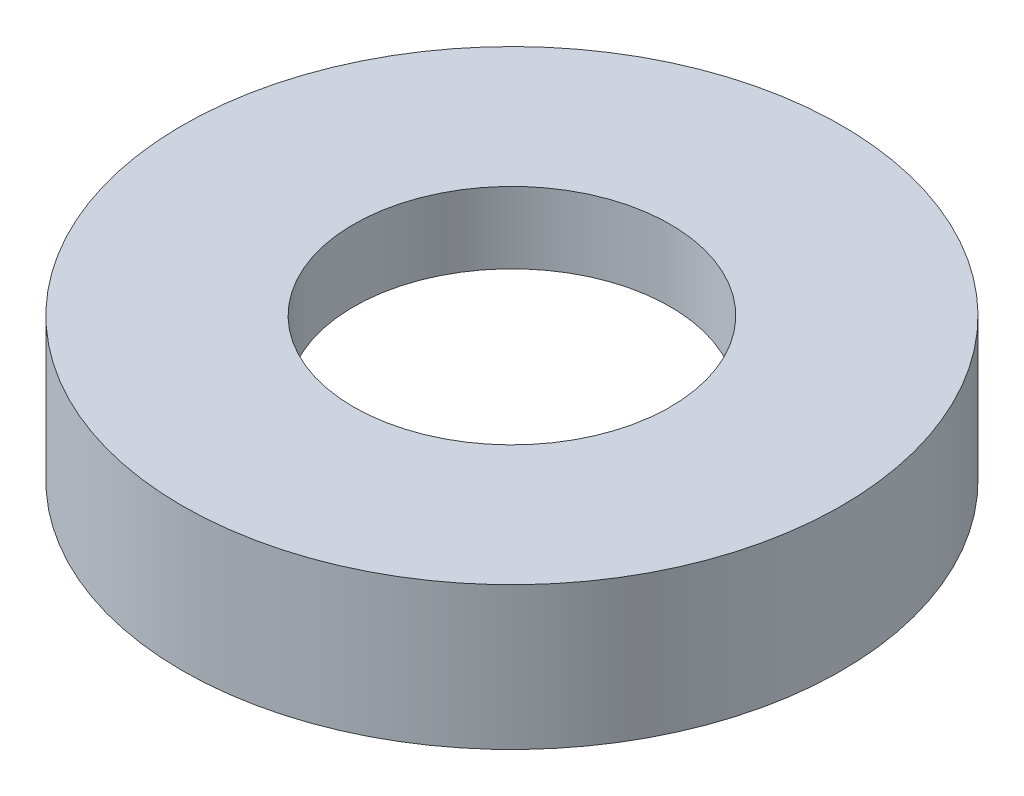
ISO-10303-21;
HEADER;
FILE_DESCRIPTION(('STEP AP214'),'2;1');
FILE_NAME('part.step','',(''),(''),'','','');
FILE_SCHEMA(('AUTOMOTIVE_DESIGN { 1 0 10303 214 1 1 1 1 }'));
ENDSEC;
DATA;
#1=APPLICATION_CONTEXT('core data for automotive mechanical design processes');
#2=APPLICATION_PROTOCOL_DEFINITION('international standard','automotive_design',2000,#1);
#3=PRODUCT_CONTEXT('',#1,'mechanical');
#4=PRODUCT('Part','Part','',(#3));
#5=PRODUCT_RELATED_PRODUCT_CATEGORY('part','',(#4));
#6=PRODUCT_DEFINITION_FORMATION('','',#4);
#7=PRODUCT_DEFINITION_CONTEXT('part definition',#1,'design');
#8=PRODUCT_DEFINITION('design','',#6,#7);
#9=PRODUCT_DEFINITION_SHAPE('','',#8);
#10=(LENGTH_UNIT() NAMED_UNIT(*) SI_UNIT(.MILLI.,.METRE.));
#11=(NAMED_UNIT(*) PLANE_ANGLE_UNIT() SI_UNIT($,.RADIAN.));
#12=(NAMED_UNIT(*) SI_UNIT($,.STERADIAN.) SOLID_ANGLE_UNIT());
#13=UNCERTAINTY_MEASURE_WITH_UNIT(LENGTH_MEASURE(1.E-05),#10,'distance_accuracy_value','');
#14=(GEOMETRIC_REPRESENTATION_CONTEXT(3) GLOBAL_UNCERTAINTY_ASSIGNED_CONTEXT((#13)) GLOBAL_UNIT_ASSIGNED_CONTEXT((#10,
#11,#12)) REPRESENTATION_CONTEXT('',''));
#15=CARTESIAN_POINT('',(0.,0.,0.));
#16=DIRECTION('',(0.,0.,1.));
#17=DIRECTION('',(1.,0.,0.));
#18=AXIS2_PLACEMENT_3D('',#15,#16,#17);
#19=CARTESIAN_POINT('',(25.4,0.,0.));
#20=DIRECTION('',(0.,1.,0.));
#21=DIRECTION('',(0.,0.,1.));
#22=AXIS2_PLACEMENT_3D('',#19,#20,#21);
#23=PLANE('',#22);
#24=CARTESIAN_POINT('',(0.,0.,0.));
#25=DIRECTION('',(0.,1.,0.));
#26=DIRECTION('',(0.,0.,1.));
#27=AXIS2_PLACEMENT_3D('',#24,#25,#26);
#28=CIRCLE('',#27,25.4);
#29=CARTESIAN_POINT('',(0.,0.,25.4));
#30=VERTEX_POINT('',#29);
#31=EDGE_CURVE('E63',#30,#30,#28,.T.);
#32=ORIENTED_EDGE('',*,*,#31,.F.);
#33=EDGE_LOOP('',(#32));
#34=FACE_BOUND('',#33,.T.);
#35=CARTESIAN_POINT('',(0.,0.,0.));
#36=DIRECTION('',(0.,1.,0.));
#37=DIRECTION('',(0.,0.,1.));
#38=AXIS2_PLACEMENT_3D('',#35,#36,#37);
#39=CIRCLE('',#38,23.5);
#40=CARTESIAN_POINT('',(0.,0.,23.5));
#41=VERTEX_POINT('',#40);
#42=EDGE_CURVE('E10',#41,#41,#39,.T.);
#43=ORIENTED_EDGE('',*,*,#42,.T.);
#44=EDGE_LOOP('',(#43));
#45=FACE_BOUND('',#44,.T.);
#46=ADVANCED_FACE('F35',(#34,#45),#23,.F.);
#47=CARTESIAN_POINT('',(0.,60.0208204142554,0.));
#48=DIRECTION('',(0.,1.,0.));
#49=DIRECTION('',(0.,0.,1.));
#50=AXIS2_PLACEMENT_3D('',#47,#48,#49);
#51=CYLINDRICAL_SURFACE('',#50,23.5);
#52=ORIENTED_EDGE('',*,*,#42,.F.);
#53=EDGE_LOOP('',(#52));
#54=FACE_BOUND('',#53,.T.);
#55=CARTESIAN_POINT('',(0.,4.5,0.));
#56=DIRECTION('',(0.,1.,0.));
#57=DIRECTION('',(0.,0.,1.));
#58=AXIS2_PLACEMENT_3D('',#55,#56,#57);
#59=CIRCLE('',#58,23.5);
#60=CARTESIAN_POINT('',(0.,4.5,23.5));
#61=VERTEX_POINT('',#60);
#62=EDGE_CURVE('E41',#61,#61,#59,.T.);
#63=ORIENTED_EDGE('',*,*,#62,.T.);
#64=EDGE_LOOP('',(#63));
#65=FACE_BOUND('',#64,.T.);
#66=ADVANCED_FACE('F70',(#54,#65),#51,.F.);
#67=CARTESIAN_POINT('',(23.5,4.5,0.));
#68=DIRECTION('',(0.,-1.,0.));
#69=DIRECTION('',(0.,0.,-1.));
#70=AXIS2_PLACEMENT_3D('',#67,#68,#69);
#71=PLANE('',#70);
#72=ORIENTED_EDGE('',*,*,#62,.F.);
#73=EDGE_LOOP('',(#72));
#74=FACE_BOUND('',#73,.T.);
#75=CARTESIAN_POINT('',(0.,4.5,0.));
#76=DIRECTION('',(0.,1.,0.));
#77=DIRECTION('',(0.,0.,1.));
#78=AXIS2_PLACEMENT_3D('',#75,#76,#77);
#79=CIRCLE('',#78,24.1);
#80=CARTESIAN_POINT('',(0.,4.5,24.1));
#81=VERTEX_POINT('',#80);
#82=EDGE_CURVE('E45',#81,#81,#79,.T.);
#83=ORIENTED_EDGE('',*,*,#82,.T.);
#84=EDGE_LOOP('',(#83));
#85=FACE_BOUND('',#84,.T.);
#86=ADVANCED_FACE('F74',(#74,#85),#71,.F.);
#87=CARTESIAN_POINT('',(0.,60.0208204142554,0.));
#88=DIRECTION('',(0.,1.,0.));
#89=DIRECTION('',(0.,0.,1.));
#90=AXIS2_PLACEMENT_3D('',#87,#88,#89);
#91=CYLINDRICAL_SURFACE('',#90,24.1);
#92=ORIENTED_EDGE('',*,*,#82,.F.);
#93=EDGE_LOOP('',(#92));
#94=FACE_BOUND('',#93,.T.);
#95=CARTESIAN_POINT('',(0.,5.5,0.));
#96=DIRECTION('',(0.,1.,0.));
#97=DIRECTION('',(0.,0.,1.));
#98=AXIS2_PLACEMENT_3D('',#95,#96,#97);
#99=CIRCLE('',#98,24.1);
#100=CARTESIAN_POINT('',(0.,5.5,24.1));
#101=VERTEX_POINT('',#100);
#102=EDGE_CURVE('E49',#101,#101,#99,.T.);
#103=ORIENTED_EDGE('',*,*,#102,.T.);
#104=EDGE_LOOP('',(#103));
#105=FACE_BOUND('',#104,.T.);
#106=ADVANCED_FACE('F79',(#94,#105),#91,.F.);
#107=CARTESIAN_POINT('',(24.1,5.5,0.));
#108=DIRECTION('',(0.,1.,0.));
#109=DIRECTION('',(0.,0.,1.));
#110=AXIS2_PLACEMENT_3D('',#107,#108,#109);
#111=PLANE('',#110);
#112=ORIENTED_EDGE('',*,*,#102,.F.);
#113=EDGE_LOOP('',(#112));
#114=FACE_BOUND('',#113,.T.);
#115=CARTESIAN_POINT('',(0.,5.5,0.));
#116=DIRECTION('',(0.,1.,0.));
#117=DIRECTION('',(0.,0.,1.));
#118=AXIS2_PLACEMENT_3D('',#115,#116,#117);
#119=CIRCLE('',#118,12.2);
#120=CARTESIAN_POINT('',(0.,5.5,12.2));
#121=VERTEX_POINT('',#120);
#122=EDGE_CURVE('E54',#121,#121,#119,.T.);
#123=ORIENTED_EDGE('',*,*,#122,.T.);
#124=EDGE_LOOP('',(#123));
#125=FACE_BOUND('',#124,.T.);
#126=ADVANCED_FACE('F85',(#114,#125),#111,.F.);
#127=CARTESIAN_POINT('',(0.,60.0208204142554,0.));
#128=DIRECTION('',(0.,1.,0.));
#129=DIRECTION('',(0.,0.,1.));
#130=AXIS2_PLACEMENT_3D('',#127,#128,#129);
#131=CYLINDRICAL_SURFACE('',#130,12.2);
#132=ORIENTED_EDGE('',*,*,#122,.F.);
#133=EDGE_LOOP('',(#132));
#134=FACE_BOUND('',#133,.T.);
#135=CARTESIAN_POINT('',(0.,11.,0.));
#136=DIRECTION('',(0.,1.,0.));
#137=DIRECTION('',(0.,0.,1.));
#138=AXIS2_PLACEMENT_3D('',#135,#136,#137);
#139=CIRCLE('',#138,12.2);
#140=CARTESIAN_POINT('',(0.,11.,12.2));
#141=VERTEX_POINT('',#140);
#142=EDGE_CURVE('E57',#141,#141,#139,.T.);
#143=ORIENTED_EDGE('',*,*,#142,.T.);
#144=EDGE_LOOP('',(#143));
#145=FACE_BOUND('',#144,.T.);
#146=ADVANCED_FACE('F89',(#134,#145),#131,.F.);
#147=CARTESIAN_POINT('',(12.2,11.,0.));
#148=DIRECTION('',(0.,-1.,0.));
#149=DIRECTION('',(0.,0.,-1.));
#150=AXIS2_PLACEMENT_3D('',#147,#148,#149);
#151=PLANE('',#150);
#152=ORIENTED_EDGE('',*,*,#142,.F.);
#153=EDGE_LOOP('',(#152));
#154=FACE_BOUND('',#153,.T.);
#155=CARTESIAN_POINT('',(0.,11.,0.));
#156=DIRECTION('',(0.,1.,0.));
#157=DIRECTION('',(0.,0.,1.));
#158=AXIS2_PLACEMENT_3D('',#155,#156,#157);
#159=CIRCLE('',#158,25.4);
#160=CARTESIAN_POINT('',(0.,11.,25.4));
#161=VERTEX_POINT('',#160);
#162=EDGE_CURVE('E60',#161,#161,#159,.T.);
#163=ORIENTED_EDGE('',*,*,#162,.T.);
#164=EDGE_LOOP('',(#163));
#165=FACE_BOUND('',#164,.T.);
#166=ADVANCED_FACE('F93',(#154,#165),#151,.F.);
#167=CARTESIAN_POINT('',(0.,60.0208204142554,0.));
#168=DIRECTION('',(0.,1.,0.));
#169=DIRECTION('',(0.,0.,1.));
#170=AXIS2_PLACEMENT_3D('',#167,#168,#169);
#171=CYLINDRICAL_SURFACE('',#170,25.4);
#172=ORIENTED_EDGE('',*,*,#162,.F.);
#173=EDGE_LOOP('',(#172));
#174=FACE_BOUND('',#173,.T.);
#175=ORIENTED_EDGE('',*,*,#31,.T.);
#176=EDGE_LOOP('',(#175));
#177=FACE_BOUND('',#176,.T.);
#178=ADVANCED_FACE('F67',(#174,#177),#171,.T.);
#179=CLOSED_SHELL('',(#46,#66,#86,#106,#126,#146,#166,#178));
#180=MANIFOLD_SOLID_BREP('B2',#179);
#181=ADVANCED_BREP_SHAPE_REPRESENTATION('',(#18,#180),#14);
#182=SHAPE_DEFINITION_REPRESENTATION(#9,#181);
ENDSEC;
END-ISO-10303-21;
